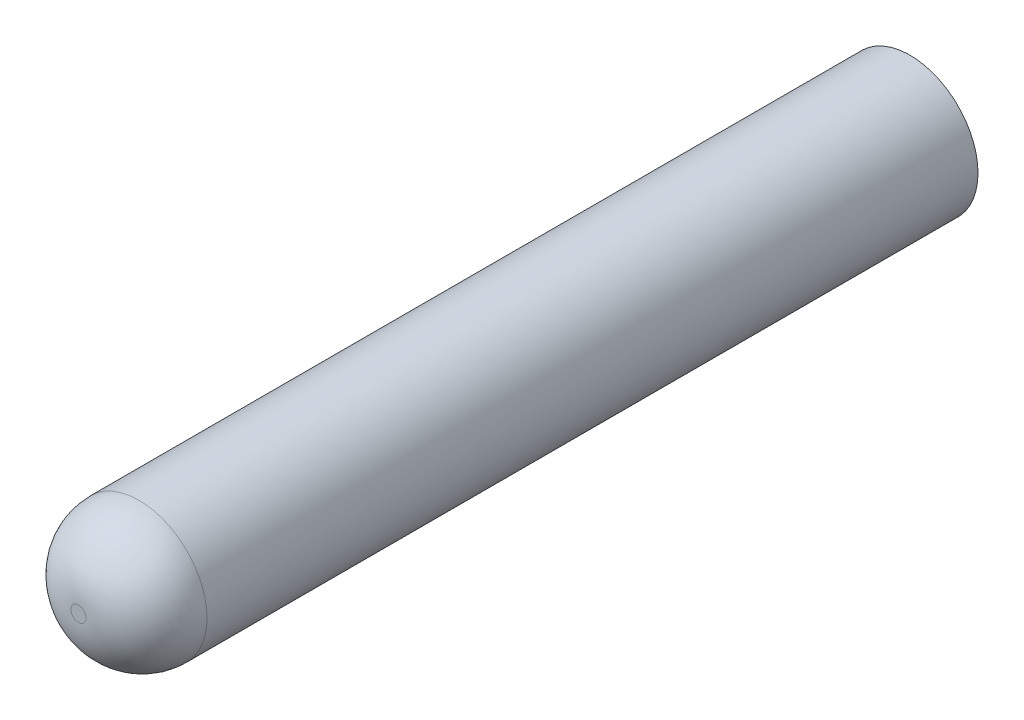
ISO-10303-21;
HEADER;
FILE_DESCRIPTION(('STEP AP214'),'2;1');
FILE_NAME('part.step','',(''),(''),'','','');
FILE_SCHEMA(('AUTOMOTIVE_DESIGN { 1 0 10303 214 1 1 1 1 }'));
ENDSEC;
DATA;
#1=APPLICATION_CONTEXT('core data for automotive mechanical design processes');
#2=APPLICATION_PROTOCOL_DEFINITION('international standard','automotive_design',2000,#1);
#3=PRODUCT_CONTEXT('',#1,'mechanical');
#4=PRODUCT('Part','Part','',(#3));
#5=PRODUCT_RELATED_PRODUCT_CATEGORY('part','',(#4));
#6=PRODUCT_DEFINITION_FORMATION('','',#4);
#7=PRODUCT_DEFINITION_CONTEXT('part definition',#1,'design');
#8=PRODUCT_DEFINITION('design','',#6,#7);
#9=PRODUCT_DEFINITION_SHAPE('','',#8);
#10=(LENGTH_UNIT() NAMED_UNIT(*) SI_UNIT(.MILLI.,.METRE.));
#11=(NAMED_UNIT(*) PLANE_ANGLE_UNIT() SI_UNIT($,.RADIAN.));
#12=(NAMED_UNIT(*) SI_UNIT($,.STERADIAN.) SOLID_ANGLE_UNIT());
#13=UNCERTAINTY_MEASURE_WITH_UNIT(LENGTH_MEASURE(1.E-05),#10,'distance_accuracy_value','');
#14=(GEOMETRIC_REPRESENTATION_CONTEXT(3) GLOBAL_UNCERTAINTY_ASSIGNED_CONTEXT((#13)) GLOBAL_UNIT_ASSIGNED_CONTEXT((#10,
#11,#12)) REPRESENTATION_CONTEXT('',''));
#15=CARTESIAN_POINT('',(0.,0.,0.));
#16=DIRECTION('',(0.,0.,1.));
#17=DIRECTION('',(1.,0.,0.));
#18=AXIS2_PLACEMENT_3D('',#15,#16,#17);
#19=CARTESIAN_POINT('',(0.,0.,27.5));
#20=DIRECTION('',(0.,0.,-1.));
#21=DIRECTION('',(-1.,0.,0.));
#22=AXIS2_PLACEMENT_3D('',#19,#20,#21);
#23=CYLINDRICAL_SURFACE('',#22,2.25);
#24=CARTESIAN_POINT('',(0.,0.,25.5));
#25=DIRECTION('',(0.,0.,1.));
#26=DIRECTION('',(1.,0.,0.));
#27=AXIS2_PLACEMENT_3D('',#24,#25,#26);
#28=CIRCLE('',#27,2.25);
#29=CARTESIAN_POINT('',(2.25,0.,25.5));
#30=VERTEX_POINT('',#29);
#31=EDGE_CURVE('E11',#30,#30,#28,.F.);
#32=ORIENTED_EDGE('',*,*,#31,.T.);
#33=EDGE_LOOP('',(#32));
#34=FACE_BOUND('',#33,.T.);
#35=CARTESIAN_POINT('',(0.,0.,0.));
#36=DIRECTION('',(0.,0.,1.));
#37=DIRECTION('',(1.,0.,0.));
#38=AXIS2_PLACEMENT_3D('',#35,#36,#37);
#39=CIRCLE('',#38,2.25);
#40=CARTESIAN_POINT('',(2.25,0.,0.));
#41=VERTEX_POINT('',#40);
#42=EDGE_CURVE('E126',#41,#41,#39,.T.);
#43=ORIENTED_EDGE('',*,*,#42,.T.);
#44=EDGE_LOOP('',(#43));
#45=FACE_BOUND('',#44,.T.);
#46=ADVANCED_FACE('F39',(#34,#45),#23,.T.);
#47=CARTESIAN_POINT('',(0.,0.,27.5));
#48=DIRECTION('',(0.,0.,1.));
#49=DIRECTION('',(1.,0.,0.));
#50=AXIS2_PLACEMENT_3D('',#47,#48,#49);
#51=PLANE('',#50);
#52=CARTESIAN_POINT('',(0.,0.,27.5));
#53=DIRECTION('',(0.,0.,1.));
#54=DIRECTION('',(1.,0.,0.));
#55=AXIS2_PLACEMENT_3D('',#52,#53,#54);
#56=CIRCLE('',#55,0.25);
#57=CARTESIAN_POINT('',(0.25,0.,27.5));
#58=VERTEX_POINT('',#57);
#59=EDGE_CURVE('E48',#58,#58,#56,.T.);
#60=ORIENTED_EDGE('',*,*,#59,.T.);
#61=EDGE_LOOP('',(#60));
#62=FACE_BOUND('',#61,.T.);
#63=ADVANCED_FACE('F137',(#62),#51,.T.);
#64=CARTESIAN_POINT('',(0.,0.,0.));
#65=DIRECTION('',(0.,0.,1.));
#66=DIRECTION('',(1.,0.,0.));
#67=AXIS2_PLACEMENT_3D('',#64,#65,#66);
#68=PLANE('',#67);
#69=DIRECTION('',(-1.,0.,0.));
#70=VECTOR('',#69,1.);
#71=CARTESIAN_POINT('',(0.,-1.2,0.));
#72=LINE('',#71,#70);
#73=CARTESIAN_POINT('',(1.2,-1.2,0.));
#74=VERTEX_POINT('',#73);
#75=CARTESIAN_POINT('',(-1.2,-1.2,0.));
#76=VERTEX_POINT('',#75);
#77=EDGE_CURVE('E90',#74,#76,#72,.T.);
#78=ORIENTED_EDGE('',*,*,#77,.F.);
#79=DIRECTION('',(0.,-1.,0.));
#80=VECTOR('',#79,1.);
#81=CARTESIAN_POINT('',(1.2,0.,0.));
#82=LINE('',#81,#80);
#83=CARTESIAN_POINT('',(1.2,1.2,0.));
#84=VERTEX_POINT('',#83);
#85=EDGE_CURVE('E55',#84,#74,#82,.T.);
#86=ORIENTED_EDGE('',*,*,#85,.F.);
#87=DIRECTION('',(1.,0.,0.));
#88=VECTOR('',#87,1.);
#89=CARTESIAN_POINT('',(0.,1.2,0.));
#90=LINE('',#89,#88);
#91=CARTESIAN_POINT('',(-1.2,1.2,0.));
#92=VERTEX_POINT('',#91);
#93=EDGE_CURVE('E110',#92,#84,#90,.T.);
#94=ORIENTED_EDGE('',*,*,#93,.F.);
#95=DIRECTION('',(0.,1.,0.));
#96=VECTOR('',#95,1.);
#97=CARTESIAN_POINT('',(-1.2,0.,0.));
#98=LINE('',#97,#96);
#99=EDGE_CURVE('E119',#76,#92,#98,.T.);
#100=ORIENTED_EDGE('',*,*,#99,.F.);
#101=EDGE_LOOP('',(#78,#86,#94,#100));
#102=FACE_BOUND('',#101,.T.);
#103=ORIENTED_EDGE('',*,*,#42,.F.);
#104=EDGE_LOOP('',(#103));
#105=FACE_BOUND('',#104,.T.);
#106=ADVANCED_FACE('F151',(#102,#105),#68,.F.);
#107=CARTESIAN_POINT('',(1.2,0.,4.5));
#108=DIRECTION('',(1.,0.,0.));
#109=DIRECTION('',(0.,0.,-1.));
#110=AXIS2_PLACEMENT_3D('',#107,#108,#109);
#111=PLANE('',#110);
#112=ORIENTED_EDGE('',*,*,#85,.T.);
#113=DIRECTION('',(0.,0.,-1.));
#114=VECTOR('',#113,1.);
#115=CARTESIAN_POINT('',(1.2,-1.2,4.5));
#116=LINE('',#115,#114);
#117=CARTESIAN_POINT('',(1.2,-1.2,4.5));
#118=VERTEX_POINT('',#117);
#119=EDGE_CURVE('E78',#118,#74,#116,.T.);
#120=ORIENTED_EDGE('',*,*,#119,.F.);
#121=DIRECTION('',(0.,-1.,0.));
#122=VECTOR('',#121,1.);
#123=CARTESIAN_POINT('',(1.2,0.,4.5));
#124=LINE('',#123,#122);
#125=CARTESIAN_POINT('',(1.2,1.2,4.5));
#126=VERTEX_POINT('',#125);
#127=EDGE_CURVE('E106',#126,#118,#124,.T.);
#128=ORIENTED_EDGE('',*,*,#127,.F.);
#129=DIRECTION('',(0.,0.,-1.));
#130=VECTOR('',#129,1.);
#131=CARTESIAN_POINT('',(1.2,1.2,4.5));
#132=LINE('',#131,#130);
#133=EDGE_CURVE('E63',#126,#84,#132,.T.);
#134=ORIENTED_EDGE('',*,*,#133,.T.);
#135=EDGE_LOOP('',(#112,#120,#128,#134));
#136=FACE_BOUND('',#135,.T.);
#137=ADVANCED_FACE('F156',(#136),#111,.F.);
#138=CARTESIAN_POINT('',(0.,1.2,4.5));
#139=DIRECTION('',(0.,1.,0.));
#140=DIRECTION('',(-1.,0.,0.));
#141=AXIS2_PLACEMENT_3D('',#138,#139,#140);
#142=PLANE('',#141);
#143=ORIENTED_EDGE('',*,*,#93,.T.);
#144=ORIENTED_EDGE('',*,*,#133,.F.);
#145=DIRECTION('',(1.,0.,0.));
#146=VECTOR('',#145,1.);
#147=CARTESIAN_POINT('',(0.,1.2,4.5));
#148=LINE('',#147,#146);
#149=CARTESIAN_POINT('',(-1.2,1.2,4.5));
#150=VERTEX_POINT('',#149);
#151=EDGE_CURVE('E103',#150,#126,#148,.T.);
#152=ORIENTED_EDGE('',*,*,#151,.F.);
#153=DIRECTION('',(0.,0.,-1.));
#154=VECTOR('',#153,1.);
#155=CARTESIAN_POINT('',(-1.2,1.2,4.5));
#156=LINE('',#155,#154);
#157=EDGE_CURVE('E95',#150,#92,#156,.T.);
#158=ORIENTED_EDGE('',*,*,#157,.T.);
#159=EDGE_LOOP('',(#143,#144,#152,#158));
#160=FACE_BOUND('',#159,.T.);
#161=ADVANCED_FACE('F161',(#160),#142,.F.);
#162=CARTESIAN_POINT('',(-1.2,0.,4.5));
#163=DIRECTION('',(-1.,0.,0.));
#164=DIRECTION('',(0.,0.,1.));
#165=AXIS2_PLACEMENT_3D('',#162,#163,#164);
#166=PLANE('',#165);
#167=ORIENTED_EDGE('',*,*,#99,.T.);
#168=ORIENTED_EDGE('',*,*,#157,.F.);
#169=DIRECTION('',(0.,1.,0.));
#170=VECTOR('',#169,1.);
#171=CARTESIAN_POINT('',(-1.2,0.,4.5));
#172=LINE('',#171,#170);
#173=CARTESIAN_POINT('',(-1.2,-1.2,4.5));
#174=VERTEX_POINT('',#173);
#175=EDGE_CURVE('E98',#174,#150,#172,.T.);
#176=ORIENTED_EDGE('',*,*,#175,.F.);
#177=DIRECTION('',(0.,0.,-1.));
#178=VECTOR('',#177,1.);
#179=CARTESIAN_POINT('',(-1.2,-1.2,4.5));
#180=LINE('',#179,#178);
#181=EDGE_CURVE('E83',#174,#76,#180,.T.);
#182=ORIENTED_EDGE('',*,*,#181,.T.);
#183=EDGE_LOOP('',(#167,#168,#176,#182));
#184=FACE_BOUND('',#183,.T.);
#185=ADVANCED_FACE('F99',(#184),#166,.F.);
#186=CARTESIAN_POINT('',(0.,-1.2,4.5));
#187=DIRECTION('',(0.,-1.,0.));
#188=DIRECTION('',(1.,0.,0.));
#189=AXIS2_PLACEMENT_3D('',#186,#187,#188);
#190=PLANE('',#189);
#191=ORIENTED_EDGE('',*,*,#77,.T.);
#192=ORIENTED_EDGE('',*,*,#181,.F.);
#193=DIRECTION('',(-1.,0.,0.));
#194=VECTOR('',#193,1.);
#195=CARTESIAN_POINT('',(0.,-1.2,4.5));
#196=LINE('',#195,#194);
#197=EDGE_CURVE('E87',#118,#174,#196,.T.);
#198=ORIENTED_EDGE('',*,*,#197,.F.);
#199=ORIENTED_EDGE('',*,*,#119,.T.);
#200=EDGE_LOOP('',(#191,#192,#198,#199));
#201=FACE_BOUND('',#200,.T.);
#202=ADVANCED_FACE('F85',(#201),#190,.F.);
#203=CARTESIAN_POINT('',(0.,0.,4.5));
#204=DIRECTION('',(0.,0.,-1.));
#205=DIRECTION('',(-1.,0.,0.));
#206=AXIS2_PLACEMENT_3D('',#203,#204,#205);
#207=PLANE('',#206);
#208=ORIENTED_EDGE('',*,*,#127,.T.);
#209=ORIENTED_EDGE('',*,*,#197,.T.);
#210=ORIENTED_EDGE('',*,*,#175,.T.);
#211=ORIENTED_EDGE('',*,*,#151,.T.);
#212=EDGE_LOOP('',(#208,#209,#210,#211));
#213=FACE_BOUND('',#212,.T.);
#214=ADVANCED_FACE('F105',(#213),#207,.T.);
#215=CARTESIAN_POINT('',(0.,0.,25.5));
#216=DIRECTION('',(0.,0.,1.));
#217=DIRECTION('',(1.,0.,0.));
#218=AXIS2_PLACEMENT_3D('',#215,#216,#217);
#219=DEGENERATE_TOROIDAL_SURFACE('',#218,0.25,2.,.T.);
#220=ORIENTED_EDGE('',*,*,#31,.F.);
#221=EDGE_LOOP('',(#220));
#222=FACE_BOUND('',#221,.T.);
#223=ORIENTED_EDGE('',*,*,#59,.F.);
#224=EDGE_LOOP('',(#223));
#225=FACE_BOUND('',#224,.T.);
#226=ADVANCED_FACE('F41',(#222,#225),#219,.T.);
#227=CLOSED_SHELL('',(#46,#63,#106,#137,#161,#185,#202,#214,#226));
#228=MANIFOLD_SOLID_BREP('B2',#227);
#229=ADVANCED_BREP_SHAPE_REPRESENTATION('',(#18,#228),#14);
#230=SHAPE_DEFINITION_REPRESENTATION(#9,#229);
ENDSEC;
END-ISO-10303-21;
